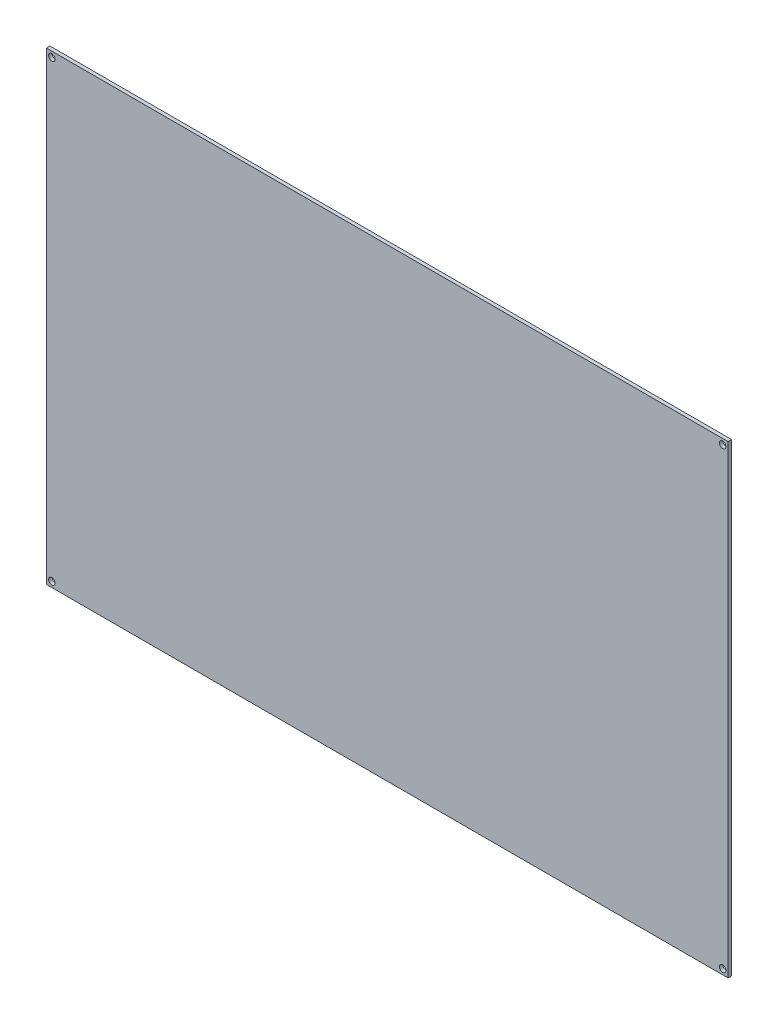
ISO-10303-21;
HEADER;
FILE_DESCRIPTION(('STEP AP214'),'2;1');
FILE_NAME('part.step','',(''),(''),'','','');
FILE_SCHEMA(('AUTOMOTIVE_DESIGN { 1 0 10303 214 1 1 1 1 }'));
ENDSEC;
DATA;
#1=APPLICATION_CONTEXT('core data for automotive mechanical design processes');
#2=APPLICATION_PROTOCOL_DEFINITION('international standard','automotive_design',2000,#1);
#3=PRODUCT_CONTEXT('',#1,'mechanical');
#4=PRODUCT('Part','Part','',(#3));
#5=PRODUCT_RELATED_PRODUCT_CATEGORY('part','',(#4));
#6=PRODUCT_DEFINITION_FORMATION('','',#4);
#7=PRODUCT_DEFINITION_CONTEXT('part definition',#1,'design');
#8=PRODUCT_DEFINITION('design','',#6,#7);
#9=PRODUCT_DEFINITION_SHAPE('','',#8);
#10=(LENGTH_UNIT() NAMED_UNIT(*) SI_UNIT(.MILLI.,.METRE.));
#11=(NAMED_UNIT(*) PLANE_ANGLE_UNIT() SI_UNIT($,.RADIAN.));
#12=(NAMED_UNIT(*) SI_UNIT($,.STERADIAN.) SOLID_ANGLE_UNIT());
#13=UNCERTAINTY_MEASURE_WITH_UNIT(LENGTH_MEASURE(1.E-05),#10,'distance_accuracy_value','');
#14=(GEOMETRIC_REPRESENTATION_CONTEXT(3) GLOBAL_UNCERTAINTY_ASSIGNED_CONTEXT((#13)) GLOBAL_UNIT_ASSIGNED_CONTEXT((#10,
#11,#12)) REPRESENTATION_CONTEXT('',''));
#15=CARTESIAN_POINT('',(0.,0.,0.));
#16=DIRECTION('',(0.,0.,1.));
#17=DIRECTION('',(1.,0.,0.));
#18=AXIS2_PLACEMENT_3D('',#15,#16,#17);
#19=CARTESIAN_POINT('',(0.,0.,-1.6));
#20=DIRECTION('',(-1.,0.,0.));
#21=DIRECTION('',(0.,0.,1.));
#22=AXIS2_PLACEMENT_3D('',#19,#20,#21);
#23=PLANE('',#22);
#24=DIRECTION('',(0.,-1.,0.));
#25=VECTOR('',#24,1.);
#26=CARTESIAN_POINT('',(0.,0.,0.));
#27=LINE('',#26,#25);
#28=CARTESIAN_POINT('',(0.,214.,0.));
#29=VERTEX_POINT('',#28);
#30=CARTESIAN_POINT('',(0.,0.,0.));
#31=VERTEX_POINT('',#30);
#32=EDGE_CURVE('E97',#29,#31,#27,.T.);
#33=ORIENTED_EDGE('',*,*,#32,.F.);
#34=DIRECTION('',(0.,0.,1.));
#35=VECTOR('',#34,1.);
#36=CARTESIAN_POINT('',(0.,214.,-1.6));
#37=LINE('',#36,#35);
#38=CARTESIAN_POINT('',(0.,214.,-1.6));
#39=VERTEX_POINT('',#38);
#40=EDGE_CURVE('E11',#39,#29,#37,.T.);
#41=ORIENTED_EDGE('',*,*,#40,.F.);
#42=DIRECTION('',(0.,-1.,0.));
#43=VECTOR('',#42,1.);
#44=CARTESIAN_POINT('',(0.,0.,-1.6));
#45=LINE('',#44,#43);
#46=CARTESIAN_POINT('',(0.,0.,-1.6));
#47=VERTEX_POINT('',#46);
#48=EDGE_CURVE('E90',#39,#47,#45,.T.);
#49=ORIENTED_EDGE('',*,*,#48,.T.);
#50=DIRECTION('',(0.,0.,1.));
#51=VECTOR('',#50,1.);
#52=CARTESIAN_POINT('',(0.,0.,-1.6));
#53=LINE('',#52,#51);
#54=EDGE_CURVE('E35',#47,#31,#53,.T.);
#55=ORIENTED_EDGE('',*,*,#54,.T.);
#56=EDGE_LOOP('',(#33,#41,#49,#55));
#57=FACE_BOUND('',#56,.T.);
#58=ADVANCED_FACE('F32',(#57),#23,.T.);
#59=CARTESIAN_POINT('',(0.,214.,-1.6));
#60=DIRECTION('',(0.,1.,0.));
#61=DIRECTION('',(0.,0.,1.));
#62=AXIS2_PLACEMENT_3D('',#59,#60,#61);
#63=PLANE('',#62);
#64=DIRECTION('',(-1.,0.,0.));
#65=VECTOR('',#64,1.);
#66=CARTESIAN_POINT('',(0.,214.,0.));
#67=LINE('',#66,#65);
#68=CARTESIAN_POINT('',(314.,214.,0.));
#69=VERTEX_POINT('',#68);
#70=EDGE_CURVE('E92',#69,#29,#67,.T.);
#71=ORIENTED_EDGE('',*,*,#70,.F.);
#72=DIRECTION('',(0.,0.,1.));
#73=VECTOR('',#72,1.);
#74=CARTESIAN_POINT('',(314.,214.,-1.6));
#75=LINE('',#74,#73);
#76=CARTESIAN_POINT('',(314.,214.,-1.6));
#77=VERTEX_POINT('',#76);
#78=EDGE_CURVE('E41',#77,#69,#75,.T.);
#79=ORIENTED_EDGE('',*,*,#78,.F.);
#80=DIRECTION('',(-1.,0.,0.));
#81=VECTOR('',#80,1.);
#82=CARTESIAN_POINT('',(0.,214.,-1.6));
#83=LINE('',#82,#81);
#84=EDGE_CURVE('E87',#77,#39,#83,.T.);
#85=ORIENTED_EDGE('',*,*,#84,.T.);
#86=ORIENTED_EDGE('',*,*,#40,.T.);
#87=EDGE_LOOP('',(#71,#79,#85,#86));
#88=FACE_BOUND('',#87,.T.);
#89=ADVANCED_FACE('F108',(#88),#63,.T.);
#90=CARTESIAN_POINT('',(314.,0.,-1.6));
#91=DIRECTION('',(1.,0.,0.));
#92=DIRECTION('',(0.,0.,-1.));
#93=AXIS2_PLACEMENT_3D('',#90,#91,#92);
#94=PLANE('',#93);
#95=DIRECTION('',(0.,1.,0.));
#96=VECTOR('',#95,1.);
#97=CARTESIAN_POINT('',(314.,0.,0.));
#98=LINE('',#97,#96);
#99=CARTESIAN_POINT('',(314.,0.,0.));
#100=VERTEX_POINT('',#99);
#101=EDGE_CURVE('E82',#100,#69,#98,.T.);
#102=ORIENTED_EDGE('',*,*,#101,.F.);
#103=DIRECTION('',(0.,0.,1.));
#104=VECTOR('',#103,1.);
#105=CARTESIAN_POINT('',(314.,0.,-1.6));
#106=LINE('',#105,#104);
#107=CARTESIAN_POINT('',(314.,0.,-1.6));
#108=VERTEX_POINT('',#107);
#109=EDGE_CURVE('E77',#108,#100,#106,.T.);
#110=ORIENTED_EDGE('',*,*,#109,.F.);
#111=DIRECTION('',(0.,1.,0.));
#112=VECTOR('',#111,1.);
#113=CARTESIAN_POINT('',(314.,0.,-1.6));
#114=LINE('',#113,#112);
#115=EDGE_CURVE('E80',#108,#77,#114,.T.);
#116=ORIENTED_EDGE('',*,*,#115,.T.);
#117=ORIENTED_EDGE('',*,*,#78,.T.);
#118=EDGE_LOOP('',(#102,#110,#116,#117));
#119=FACE_BOUND('',#118,.T.);
#120=ADVANCED_FACE('F79',(#119),#94,.T.);
#121=CARTESIAN_POINT('',(0.,0.,-1.6));
#122=DIRECTION('',(0.,-1.,0.));
#123=DIRECTION('',(0.,0.,-1.));
#124=AXIS2_PLACEMENT_3D('',#121,#122,#123);
#125=PLANE('',#124);
#126=DIRECTION('',(1.,0.,0.));
#127=VECTOR('',#126,1.);
#128=CARTESIAN_POINT('',(0.,0.,0.));
#129=LINE('',#128,#127);
#130=EDGE_CURVE('E100',#31,#100,#129,.T.);
#131=ORIENTED_EDGE('',*,*,#130,.F.);
#132=ORIENTED_EDGE('',*,*,#54,.F.);
#133=DIRECTION('',(1.,0.,0.));
#134=VECTOR('',#133,1.);
#135=CARTESIAN_POINT('',(0.,0.,-1.6));
#136=LINE('',#135,#134);
#137=EDGE_CURVE('E86',#47,#108,#136,.T.);
#138=ORIENTED_EDGE('',*,*,#137,.T.);
#139=ORIENTED_EDGE('',*,*,#109,.T.);
#140=EDGE_LOOP('',(#131,#132,#138,#139));
#141=FACE_BOUND('',#140,.T.);
#142=ADVANCED_FACE('F89',(#141),#125,.T.);
#143=CARTESIAN_POINT('',(0.,0.,-1.6));
#144=DIRECTION('',(0.,0.,-1.));
#145=DIRECTION('',(-1.,0.,0.));
#146=AXIS2_PLACEMENT_3D('',#143,#144,#145);
#147=PLANE('',#146);
#148=CARTESIAN_POINT('',(311.5,2.50000000000006,-1.6));
#149=DIRECTION('',(0.,0.,1.));
#150=DIRECTION('',(1.,0.,0.));
#151=AXIS2_PLACEMENT_3D('',#148,#149,#150);
#152=CIRCLE('',#151,1.49999999999997);
#153=CARTESIAN_POINT('',(313.,2.50000000000006,-1.6));
#154=VERTEX_POINT('',#153);
#155=EDGE_CURVE('E149',#154,#154,#152,.T.);
#156=ORIENTED_EDGE('',*,*,#155,.T.);
#157=EDGE_LOOP('',(#156));
#158=FACE_BOUND('',#157,.T.);
#159=CARTESIAN_POINT('',(2.5,2.49999999999995,-1.6));
#160=DIRECTION('',(0.,0.,1.));
#161=DIRECTION('',(-1.,0.,0.));
#162=AXIS2_PLACEMENT_3D('',#159,#160,#161);
#163=CIRCLE('',#162,1.5);
#164=CARTESIAN_POINT('',(1.,2.49999999999995,-1.6));
#165=VERTEX_POINT('',#164);
#166=EDGE_CURVE('E157',#165,#165,#163,.T.);
#167=ORIENTED_EDGE('',*,*,#166,.T.);
#168=EDGE_LOOP('',(#167));
#169=FACE_BOUND('',#168,.T.);
#170=CARTESIAN_POINT('',(311.5,211.5,-1.6));
#171=DIRECTION('',(0.,0.,1.));
#172=DIRECTION('',(-1.,0.,0.));
#173=AXIS2_PLACEMENT_3D('',#170,#171,#172);
#174=CIRCLE('',#173,1.49999999999997);
#175=CARTESIAN_POINT('',(310.,211.5,-1.6));
#176=VERTEX_POINT('',#175);
#177=EDGE_CURVE('E163',#176,#176,#174,.T.);
#178=ORIENTED_EDGE('',*,*,#177,.T.);
#179=EDGE_LOOP('',(#178));
#180=FACE_BOUND('',#179,.T.);
#181=CARTESIAN_POINT('',(2.5,211.5,-1.6));
#182=DIRECTION('',(0.,0.,1.));
#183=DIRECTION('',(1.,0.,0.));
#184=AXIS2_PLACEMENT_3D('',#181,#182,#183);
#185=CIRCLE('',#184,1.5);
#186=CARTESIAN_POINT('',(4.,211.5,-1.6));
#187=VERTEX_POINT('',#186);
#188=EDGE_CURVE('E101',#187,#187,#185,.T.);
#189=ORIENTED_EDGE('',*,*,#188,.T.);
#190=EDGE_LOOP('',(#189));
#191=FACE_BOUND('',#190,.T.);
#192=ORIENTED_EDGE('',*,*,#48,.F.);
#193=ORIENTED_EDGE('',*,*,#84,.F.);
#194=ORIENTED_EDGE('',*,*,#115,.F.);
#195=ORIENTED_EDGE('',*,*,#137,.F.);
#196=EDGE_LOOP('',(#192,#193,#194,#195));
#197=FACE_BOUND('',#196,.T.);
#198=ADVANCED_FACE('F85',(#158,#169,#180,#191,#197),#147,.T.);
#199=CARTESIAN_POINT('',(0.,0.,0.));
#200=DIRECTION('',(0.,0.,-1.));
#201=DIRECTION('',(-1.,0.,0.));
#202=AXIS2_PLACEMENT_3D('',#199,#200,#201);
#203=PLANE('',#202);
#204=CARTESIAN_POINT('',(311.5,2.50000000000006,0.));
#205=DIRECTION('',(0.,0.,1.));
#206=DIRECTION('',(1.,0.,0.));
#207=AXIS2_PLACEMENT_3D('',#204,#205,#206);
#208=CIRCLE('',#207,1.49999999999997);
#209=CARTESIAN_POINT('',(313.,2.50000000000006,0.));
#210=VERTEX_POINT('',#209);
#211=EDGE_CURVE('E152',#210,#210,#208,.T.);
#212=ORIENTED_EDGE('',*,*,#211,.F.);
#213=EDGE_LOOP('',(#212));
#214=FACE_BOUND('',#213,.T.);
#215=CARTESIAN_POINT('',(2.5,2.49999999999995,0.));
#216=DIRECTION('',(0.,0.,1.));
#217=DIRECTION('',(-1.,0.,0.));
#218=AXIS2_PLACEMENT_3D('',#215,#216,#217);
#219=CIRCLE('',#218,1.5);
#220=CARTESIAN_POINT('',(1.,2.49999999999995,0.));
#221=VERTEX_POINT('',#220);
#222=EDGE_CURVE('E154',#221,#221,#219,.T.);
#223=ORIENTED_EDGE('',*,*,#222,.F.);
#224=EDGE_LOOP('',(#223));
#225=FACE_BOUND('',#224,.T.);
#226=CARTESIAN_POINT('',(311.5,211.5,0.));
#227=DIRECTION('',(0.,0.,1.));
#228=DIRECTION('',(-1.,0.,0.));
#229=AXIS2_PLACEMENT_3D('',#226,#227,#228);
#230=CIRCLE('',#229,1.49999999999997);
#231=CARTESIAN_POINT('',(310.,211.5,0.));
#232=VERTEX_POINT('',#231);
#233=EDGE_CURVE('E160',#232,#232,#230,.T.);
#234=ORIENTED_EDGE('',*,*,#233,.F.);
#235=EDGE_LOOP('',(#234));
#236=FACE_BOUND('',#235,.T.);
#237=CARTESIAN_POINT('',(2.5,211.5,0.));
#238=DIRECTION('',(0.,0.,1.));
#239=DIRECTION('',(1.,0.,0.));
#240=AXIS2_PLACEMENT_3D('',#237,#238,#239);
#241=CIRCLE('',#240,1.5);
#242=CARTESIAN_POINT('',(4.,211.5,0.));
#243=VERTEX_POINT('',#242);
#244=EDGE_CURVE('E166',#243,#243,#241,.T.);
#245=ORIENTED_EDGE('',*,*,#244,.F.);
#246=EDGE_LOOP('',(#245));
#247=FACE_BOUND('',#246,.T.);
#248=ORIENTED_EDGE('',*,*,#32,.T.);
#249=ORIENTED_EDGE('',*,*,#130,.T.);
#250=ORIENTED_EDGE('',*,*,#101,.T.);
#251=ORIENTED_EDGE('',*,*,#70,.T.);
#252=EDGE_LOOP('',(#248,#249,#250,#251));
#253=FACE_BOUND('',#252,.T.);
#254=ADVANCED_FACE('F107',(#214,#225,#236,#247,#253),#203,.F.);
#255=CARTESIAN_POINT('',(2.5,211.5,-1.6));
#256=DIRECTION('',(0.,0.,1.));
#257=DIRECTION('',(1.,0.,0.));
#258=AXIS2_PLACEMENT_3D('',#255,#256,#257);
#259=CYLINDRICAL_SURFACE('',#258,1.5);
#260=ORIENTED_EDGE('',*,*,#188,.F.);
#261=EDGE_LOOP('',(#260));
#262=FACE_BOUND('',#261,.T.);
#263=ORIENTED_EDGE('',*,*,#244,.T.);
#264=EDGE_LOOP('',(#263));
#265=FACE_BOUND('',#264,.T.);
#266=ADVANCED_FACE('F126',(#262,#265),#259,.F.);
#267=CARTESIAN_POINT('',(311.5,211.5,-1.6));
#268=DIRECTION('',(0.,0.,1.));
#269=DIRECTION('',(1.,0.,0.));
#270=AXIS2_PLACEMENT_3D('',#267,#268,#269);
#271=CYLINDRICAL_SURFACE('',#270,1.49999999999997);
#272=ORIENTED_EDGE('',*,*,#177,.F.);
#273=EDGE_LOOP('',(#272));
#274=FACE_BOUND('',#273,.T.);
#275=ORIENTED_EDGE('',*,*,#233,.T.);
#276=EDGE_LOOP('',(#275));
#277=FACE_BOUND('',#276,.T.);
#278=ADVANCED_FACE('F133',(#274,#277),#271,.F.);
#279=CARTESIAN_POINT('',(2.5,2.49999999999995,-1.6));
#280=DIRECTION('',(0.,0.,1.));
#281=DIRECTION('',(1.,0.,0.));
#282=AXIS2_PLACEMENT_3D('',#279,#280,#281);
#283=CYLINDRICAL_SURFACE('',#282,1.5);
#284=ORIENTED_EDGE('',*,*,#166,.F.);
#285=EDGE_LOOP('',(#284));
#286=FACE_BOUND('',#285,.T.);
#287=ORIENTED_EDGE('',*,*,#222,.T.);
#288=EDGE_LOOP('',(#287));
#289=FACE_BOUND('',#288,.T.);
#290=ADVANCED_FACE('F137',(#286,#289),#283,.F.);
#291=CARTESIAN_POINT('',(311.5,2.50000000000006,-1.6));
#292=DIRECTION('',(0.,0.,1.));
#293=DIRECTION('',(1.,0.,0.));
#294=AXIS2_PLACEMENT_3D('',#291,#292,#293);
#295=CYLINDRICAL_SURFACE('',#294,1.49999999999997);
#296=ORIENTED_EDGE('',*,*,#155,.F.);
#297=EDGE_LOOP('',(#296));
#298=FACE_BOUND('',#297,.T.);
#299=ORIENTED_EDGE('',*,*,#211,.T.);
#300=EDGE_LOOP('',(#299));
#301=FACE_BOUND('',#300,.T.);
#302=ADVANCED_FACE('F141',(#298,#301),#295,.F.);
#303=CLOSED_SHELL('',(#58,#89,#120,#142,#198,#254,#266,#278,#290,#302));
#304=MANIFOLD_SOLID_BREP('B2',#303);
#305=ADVANCED_BREP_SHAPE_REPRESENTATION('',(#18,#304),#14);
#306=SHAPE_DEFINITION_REPRESENTATION(#9,#305);
ENDSEC;
END-ISO-10303-21;
